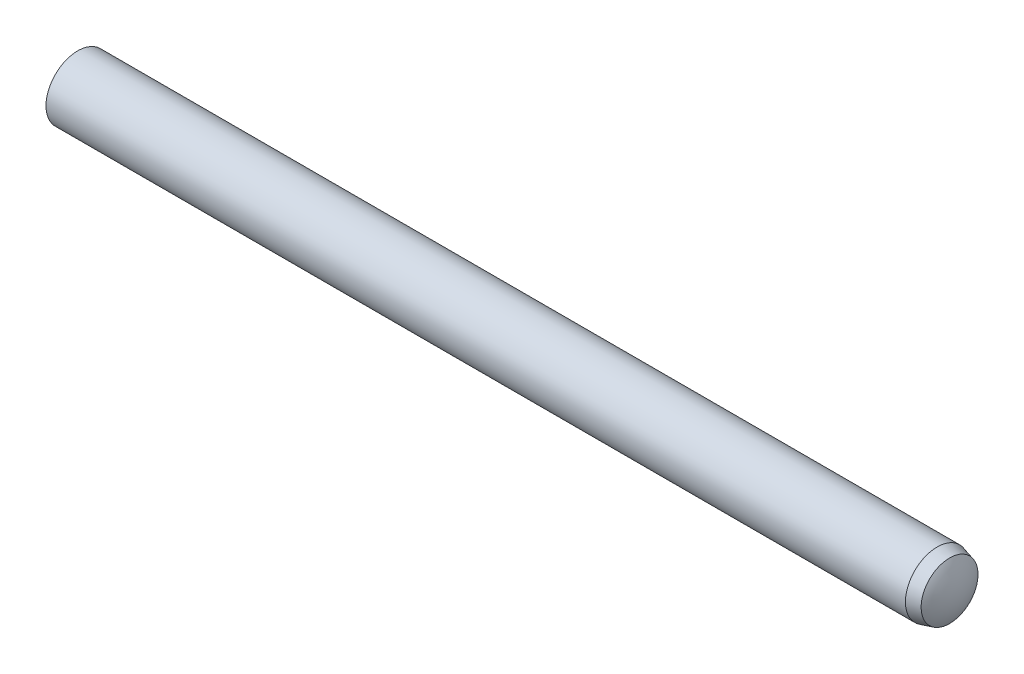
ISO-10303-21;
HEADER;
FILE_DESCRIPTION(('STEP AP214'),'2;1');
FILE_NAME('part.step','',(''),(''),'','','');
FILE_SCHEMA(('AUTOMOTIVE_DESIGN { 1 0 10303 214 1 1 1 1 }'));
ENDSEC;
DATA;
#1=APPLICATION_CONTEXT('core data for automotive mechanical design processes');
#2=APPLICATION_PROTOCOL_DEFINITION('international standard','automotive_design',2000,#1);
#3=PRODUCT_CONTEXT('',#1,'mechanical');
#4=PRODUCT('Part','Part','',(#3));
#5=PRODUCT_RELATED_PRODUCT_CATEGORY('part','',(#4));
#6=PRODUCT_DEFINITION_FORMATION('','',#4);
#7=PRODUCT_DEFINITION_CONTEXT('part definition',#1,'design');
#8=PRODUCT_DEFINITION('design','',#6,#7);
#9=PRODUCT_DEFINITION_SHAPE('','',#8);
#10=(LENGTH_UNIT() NAMED_UNIT(*) SI_UNIT(.MILLI.,.METRE.));
#11=(NAMED_UNIT(*) PLANE_ANGLE_UNIT() SI_UNIT($,.RADIAN.));
#12=(NAMED_UNIT(*) SI_UNIT($,.STERADIAN.) SOLID_ANGLE_UNIT());
#13=UNCERTAINTY_MEASURE_WITH_UNIT(LENGTH_MEASURE(1.E-05),#10,'distance_accuracy_value','');
#14=(GEOMETRIC_REPRESENTATION_CONTEXT(3) GLOBAL_UNCERTAINTY_ASSIGNED_CONTEXT((#13)) GLOBAL_UNIT_ASSIGNED_CONTEXT((#10,
#11,#12)) REPRESENTATION_CONTEXT('',''));
#15=CARTESIAN_POINT('',(0.,0.,0.));
#16=DIRECTION('',(0.,0.,1.));
#17=DIRECTION('',(1.,0.,0.));
#18=AXIS2_PLACEMENT_3D('',#15,#16,#17);
#19=CARTESIAN_POINT('',(-35.,0.,0.));
#20=DIRECTION('',(1.,0.,0.));
#21=DIRECTION('',(0.,0.,-1.));
#22=AXIS2_PLACEMENT_3D('',#19,#20,#21);
#23=CYLINDRICAL_SURFACE('',#22,2.5);
#24=CARTESIAN_POINT('',(33.375,0.,0.));
#25=DIRECTION('',(-1.,0.,0.));
#26=DIRECTION('',(0.,0.,1.));
#27=AXIS2_PLACEMENT_3D('',#24,#25,#26);
#28=CIRCLE('',#27,2.5);
#29=CARTESIAN_POINT('',(33.375,0.,2.5));
#30=VERTEX_POINT('',#29);
#31=EDGE_CURVE('E11',#30,#30,#28,.T.);
#32=ORIENTED_EDGE('',*,*,#31,.T.);
#33=EDGE_LOOP('',(#32));
#34=FACE_BOUND('',#33,.T.);
#35=CARTESIAN_POINT('',(-34.25,0.,0.));
#36=DIRECTION('',(-1.,0.,0.));
#37=DIRECTION('',(0.,0.,1.));
#38=AXIS2_PLACEMENT_3D('',#35,#36,#37);
#39=CIRCLE('',#38,2.5);
#40=CARTESIAN_POINT('',(-34.25,0.,2.5));
#41=VERTEX_POINT('',#40);
#42=EDGE_CURVE('E52',#41,#41,#39,.T.);
#43=ORIENTED_EDGE('',*,*,#42,.F.);
#44=EDGE_LOOP('',(#43));
#45=FACE_BOUND('',#44,.T.);
#46=ADVANCED_FACE('F32',(#34,#45),#23,.T.);
#47=CARTESIAN_POINT('',(33.375,0.,0.));
#48=DIRECTION('',(-1.,0.,0.));
#49=DIRECTION('',(0.,0.,1.));
#50=AXIS2_PLACEMENT_3D('',#47,#48,#49);
#51=CONICAL_SURFACE('',#50,2.5,0.26179938779915);
#52=CARTESIAN_POINT('',(34.35,0.,0.));
#53=DIRECTION('',(-1.,0.,0.));
#54=DIRECTION('',(0.,0.,1.));
#55=AXIS2_PLACEMENT_3D('',#52,#53,#54);
#56=CIRCLE('',#55,2.23874953737966);
#57=CARTESIAN_POINT('',(34.35,0.,2.23874953737966));
#58=VERTEX_POINT('',#57);
#59=EDGE_CURVE('E39',#58,#58,#56,.T.);
#60=ORIENTED_EDGE('',*,*,#59,.T.);
#61=EDGE_LOOP('',(#60));
#62=FACE_BOUND('',#61,.T.);
#63=ORIENTED_EDGE('',*,*,#31,.F.);
#64=EDGE_LOOP('',(#63));
#65=FACE_BOUND('',#64,.T.);
#66=ADVANCED_FACE('F58',(#62,#65),#51,.T.);
#67=CARTESIAN_POINT('',(30.8196157760634,0.,0.));
#68=DIRECTION('',(-1.,0.,0.));
#69=DIRECTION('',(0.,1.,0.));
#70=AXIS2_PLACEMENT_3D('',#67,#68,#69);
#71=SPHERICAL_SURFACE('',#70,4.18038422393658);
#72=CARTESIAN_POINT('',(35.,0.,0.));
#73=VERTEX_POINT('',#72);
#74=VERTEX_LOOP('',#73);
#75=FACE_BOUND('',#74,.T.);
#76=ORIENTED_EDGE('',*,*,#59,.F.);
#77=EDGE_LOOP('',(#76));
#78=FACE_BOUND('',#77,.T.);
#79=ADVANCED_FACE('F48',(#75,#78),#71,.T.);
#80=CARTESIAN_POINT('',(-30.4583333333333,0.,0.));
#81=DIRECTION('',(-1.,0.,0.));
#82=DIRECTION('',(0.,-1.,0.));
#83=AXIS2_PLACEMENT_3D('',#80,#81,#82);
#84=SPHERICAL_SURFACE('',#83,4.54166666666667);
#85=CARTESIAN_POINT('',(-35.,0.,0.));
#86=VERTEX_POINT('',#85);
#87=VERTEX_LOOP('',#86);
#88=FACE_BOUND('',#87,.T.);
#89=ORIENTED_EDGE('',*,*,#42,.T.);
#90=EDGE_LOOP('',(#89));
#91=FACE_BOUND('',#90,.T.);
#92=ADVANCED_FACE('F45',(#88,#91),#84,.T.);
#93=CLOSED_SHELL('',(#46,#66,#79,#92));
#94=MANIFOLD_SOLID_BREP('B2',#93);
#95=ADVANCED_BREP_SHAPE_REPRESENTATION('',(#18,#94),#14);
#96=SHAPE_DEFINITION_REPRESENTATION(#9,#95);
ENDSEC;
END-ISO-10303-21;
